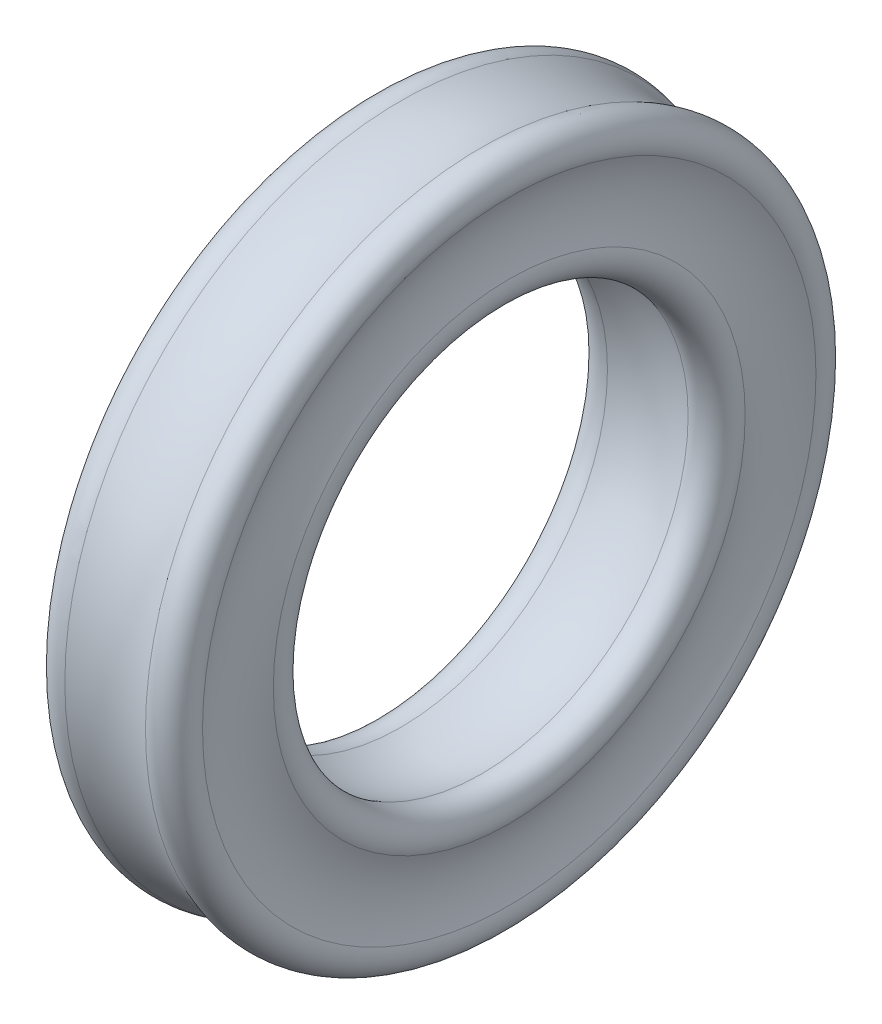
ISO-10303-21;
HEADER;
FILE_DESCRIPTION(('STEP AP214'),'2;1');
FILE_NAME('part.step','',(''),(''),'','','');
FILE_SCHEMA(('AUTOMOTIVE_DESIGN { 1 0 10303 214 1 1 1 1 }'));
ENDSEC;
DATA;
#1=APPLICATION_CONTEXT('core data for automotive mechanical design processes');
#2=APPLICATION_PROTOCOL_DEFINITION('international standard','automotive_design',2000,#1);
#3=PRODUCT_CONTEXT('',#1,'mechanical');
#4=PRODUCT('Part','Part','',(#3));
#5=PRODUCT_RELATED_PRODUCT_CATEGORY('part','',(#4));
#6=PRODUCT_DEFINITION_FORMATION('','',#4);
#7=PRODUCT_DEFINITION_CONTEXT('part definition',#1,'design');
#8=PRODUCT_DEFINITION('design','',#6,#7);
#9=PRODUCT_DEFINITION_SHAPE('','',#8);
#10=(LENGTH_UNIT() NAMED_UNIT(*) SI_UNIT(.MILLI.,.METRE.));
#11=(NAMED_UNIT(*) PLANE_ANGLE_UNIT() SI_UNIT($,.RADIAN.));
#12=(NAMED_UNIT(*) SI_UNIT($,.STERADIAN.) SOLID_ANGLE_UNIT());
#13=UNCERTAINTY_MEASURE_WITH_UNIT(LENGTH_MEASURE(1.E-05),#10,'distance_accuracy_value','');
#14=(GEOMETRIC_REPRESENTATION_CONTEXT(3) GLOBAL_UNCERTAINTY_ASSIGNED_CONTEXT((#13)) GLOBAL_UNIT_ASSIGNED_CONTEXT((#10,
#11,#12)) REPRESENTATION_CONTEXT('',''));
#15=CARTESIAN_POINT('',(0.,0.,0.));
#16=DIRECTION('',(0.,0.,1.));
#17=DIRECTION('',(1.,0.,0.));
#18=AXIS2_PLACEMENT_3D('',#15,#16,#17);
#19=CARTESIAN_POINT('',(0.,0.,0.));
#20=DIRECTION('',(1.,0.,0.));
#21=DIRECTION('',(0.,0.,-1.));
#22=AXIS2_PLACEMENT_3D('',#19,#20,#21);
#23=DEGENERATE_TOROIDAL_SURFACE('',#22,3.83118922012803,4.12518600000002,.T.);
#24=CARTESIAN_POINT('',(1.49686536342219,0.,0.));
#25=DIRECTION('',(1.,0.,0.));
#26=DIRECTION('',(0.,0.,-1.));
#27=AXIS2_PLACEMENT_3D('',#24,#25,#26);
#28=CIRCLE('',#27,7.67521752626512);
#29=CARTESIAN_POINT('',(1.49686536342219,0.,-7.67521752626512));
#30=VERTEX_POINT('',#29);
#31=EDGE_CURVE('E86',#30,#30,#28,.F.);
#32=ORIENTED_EDGE('',*,*,#31,.F.);
#33=EDGE_LOOP('',(#32));
#34=FACE_BOUND('',#33,.T.);
#35=CARTESIAN_POINT('',(-1.49686531743815,0.,0.));
#36=DIRECTION('',(1.,0.,0.));
#37=DIRECTION('',(0.,0.,-1.));
#38=AXIS2_PLACEMENT_3D('',#35,#36,#37);
#39=CIRCLE('',#38,7.67521754417131);
#40=CARTESIAN_POINT('',(-1.49686531743815,0.,-7.67521754417131));
#41=VERTEX_POINT('',#40);
#42=EDGE_CURVE('E83',#41,#41,#39,.T.);
#43=ORIENTED_EDGE('',*,*,#42,.F.);
#44=EDGE_LOOP('',(#43));
#45=FACE_BOUND('',#44,.T.);
#46=ADVANCED_FACE('F14',(#34,#45),#23,.F.);
#47=CARTESIAN_POINT('',(1.79084,0.,0.));
#48=DIRECTION('',(1.,0.,0.));
#49=DIRECTION('',(0.,0.,-1.));
#50=AXIS2_PLACEMENT_3D('',#47,#48,#49);
#51=TOROIDAL_SURFACE('',#50,8.43016,0.810160000000001);
#52=ORIENTED_EDGE('',*,*,#31,.T.);
#53=EDGE_LOOP('',(#52));
#54=FACE_BOUND('',#53,.T.);
#55=CARTESIAN_POINT('',(2.53259310120723,0.,0.));
#56=DIRECTION('',(1.,0.,0.));
#57=DIRECTION('',(0.,0.,-1.));
#58=AXIS2_PLACEMENT_3D('',#55,#56,#57);
#59=CIRCLE('',#58,8.7559844350098);
#60=CARTESIAN_POINT('',(2.53259310120723,0.,-8.7559844350098));
#61=VERTEX_POINT('',#60);
#62=EDGE_CURVE('E64',#61,#61,#59,.T.);
#63=ORIENTED_EDGE('',*,*,#62,.T.);
#64=EDGE_LOOP('',(#63));
#65=FACE_BOUND('',#64,.T.);
#66=ADVANCED_FACE('F77',(#54,#65),#51,.T.);
#67=CARTESIAN_POINT('',(-1.79084,0.,0.));
#68=DIRECTION('',(1.,0.,0.));
#69=DIRECTION('',(0.,0.,-1.));
#70=AXIS2_PLACEMENT_3D('',#67,#68,#69);
#71=TOROIDAL_SURFACE('',#70,8.43016,0.810159999999999);
#72=CARTESIAN_POINT('',(-2.53259308457556,0.,0.));
#73=DIRECTION('',(1.,0.,0.));
#74=DIRECTION('',(0.,0.,-1.));
#75=AXIS2_PLACEMENT_3D('',#72,#73,#74);
#76=CIRCLE('',#75,8.7559844728725);
#77=CARTESIAN_POINT('',(-2.53259308457556,0.,-8.7559844728725));
#78=VERTEX_POINT('',#77);
#79=EDGE_CURVE('E58',#78,#78,#76,.F.);
#80=ORIENTED_EDGE('',*,*,#79,.T.);
#81=EDGE_LOOP('',(#80));
#82=FACE_BOUND('',#81,.T.);
#83=ORIENTED_EDGE('',*,*,#42,.T.);
#84=EDGE_LOOP('',(#83));
#85=FACE_BOUND('',#84,.T.);
#86=ADVANCED_FACE('F73',(#82,#85),#71,.T.);
#87=CARTESIAN_POINT('',(5.52400531604214,0.,0.));
#88=DIRECTION('',(1.,0.,0.));
#89=DIRECTION('',(0.,0.,-1.));
#90=AXIS2_PLACEMENT_3D('',#87,#88,#89);
#91=TOROIDAL_SURFACE('',#90,10.07,3.26729);
#92=CARTESIAN_POINT('',(2.53259308457556,0.,0.));
#93=DIRECTION('',(1.,0.,0.));
#94=DIRECTION('',(0.,0.,-1.));
#95=AXIS2_PLACEMENT_3D('',#92,#93,#94);
#96=CIRCLE('',#95,11.3840155271275);
#97=CARTESIAN_POINT('',(2.53259308457556,0.,-11.3840155271275));
#98=VERTEX_POINT('',#97);
#99=EDGE_CURVE('E55',#98,#98,#96,.F.);
#100=ORIENTED_EDGE('',*,*,#99,.F.);
#101=EDGE_LOOP('',(#100));
#102=FACE_BOUND('',#101,.T.);
#103=ORIENTED_EDGE('',*,*,#62,.F.);
#104=EDGE_LOOP('',(#103));
#105=FACE_BOUND('',#104,.T.);
#106=ADVANCED_FACE('F70',(#102,#105),#91,.F.);
#107=CARTESIAN_POINT('',(-5.52400531604212,0.,0.));
#108=DIRECTION('',(1.,0.,0.));
#109=DIRECTION('',(0.,0.,-1.));
#110=AXIS2_PLACEMENT_3D('',#107,#108,#109);
#111=TOROIDAL_SURFACE('',#110,10.07,3.26728999999999);
#112=ORIENTED_EDGE('',*,*,#79,.F.);
#113=EDGE_LOOP('',(#112));
#114=FACE_BOUND('',#113,.T.);
#115=CARTESIAN_POINT('',(-2.53259309326813,0.,0.));
#116=DIRECTION('',(1.,0.,0.));
#117=DIRECTION('',(0.,0.,-1.));
#118=AXIS2_PLACEMENT_3D('',#115,#116,#117);
#119=CIRCLE('',#118,11.3840155469165);
#120=CARTESIAN_POINT('',(-2.53259309326813,0.,-11.3840155469165));
#121=VERTEX_POINT('',#120);
#122=EDGE_CURVE('E26',#121,#121,#119,.T.);
#123=ORIENTED_EDGE('',*,*,#122,.F.);
#124=EDGE_LOOP('',(#123));
#125=FACE_BOUND('',#124,.T.);
#126=ADVANCED_FACE('F48',(#114,#125),#111,.F.);
#127=CARTESIAN_POINT('',(1.79084,0.,0.));
#128=DIRECTION('',(1.,0.,0.));
#129=DIRECTION('',(0.,0.,-1.));
#130=AXIS2_PLACEMENT_3D('',#127,#128,#129);
#131=TOROIDAL_SURFACE('',#130,11.70984,0.810159999999998);
#132=ORIENTED_EDGE('',*,*,#99,.T.);
#133=EDGE_LOOP('',(#132));
#134=FACE_BOUND('',#133,.T.);
#135=CARTESIAN_POINT('',(1.49686531743814,0.,0.));
#136=DIRECTION('',(1.,0.,0.));
#137=DIRECTION('',(0.,0.,-1.));
#138=AXIS2_PLACEMENT_3D('',#135,#136,#137);
#139=CIRCLE('',#138,12.4647824558287);
#140=CARTESIAN_POINT('',(1.49686531743814,0.,-12.4647824558287));
#141=VERTEX_POINT('',#140);
#142=EDGE_CURVE('E21',#141,#141,#139,.T.);
#143=ORIENTED_EDGE('',*,*,#142,.T.);
#144=EDGE_LOOP('',(#143));
#145=FACE_BOUND('',#144,.T.);
#146=ADVANCED_FACE('F44',(#134,#145),#131,.T.);
#147=CARTESIAN_POINT('',(-1.79084,0.,0.));
#148=DIRECTION('',(1.,0.,0.));
#149=DIRECTION('',(0.,0.,-1.));
#150=AXIS2_PLACEMENT_3D('',#147,#148,#149);
#151=TOROIDAL_SURFACE('',#150,11.70984,0.810160000000001);
#152=CARTESIAN_POINT('',(-1.49686536342219,0.,0.));
#153=DIRECTION('',(1.,0.,0.));
#154=DIRECTION('',(0.,0.,-1.));
#155=AXIS2_PLACEMENT_3D('',#152,#153,#154);
#156=CIRCLE('',#155,12.4647824737349);
#157=CARTESIAN_POINT('',(-1.49686536342219,0.,-12.4647824737349));
#158=VERTEX_POINT('',#157);
#159=EDGE_CURVE('E9',#158,#158,#156,.F.);
#160=ORIENTED_EDGE('',*,*,#159,.T.);
#161=EDGE_LOOP('',(#160));
#162=FACE_BOUND('',#161,.T.);
#163=ORIENTED_EDGE('',*,*,#122,.T.);
#164=EDGE_LOOP('',(#163));
#165=FACE_BOUND('',#164,.T.);
#166=ADVANCED_FACE('F39',(#162,#165),#151,.T.);
#167=CARTESIAN_POINT('',(0.,0.,0.));
#168=DIRECTION('',(1.,0.,0.));
#169=DIRECTION('',(0.,0.,-1.));
#170=AXIS2_PLACEMENT_3D('',#167,#168,#169);
#171=TOROIDAL_SURFACE('',#170,16.308810779872,4.12518600000003);
#172=ORIENTED_EDGE('',*,*,#159,.F.);
#173=EDGE_LOOP('',(#172));
#174=FACE_BOUND('',#173,.T.);
#175=ORIENTED_EDGE('',*,*,#142,.F.);
#176=EDGE_LOOP('',(#175));
#177=FACE_BOUND('',#176,.T.);
#178=ADVANCED_FACE('F43',(#174,#177),#171,.F.);
#179=CLOSED_SHELL('',(#46,#66,#86,#106,#126,#146,#166,#178));
#180=MANIFOLD_SOLID_BREP('B1',#179);
#181=ADVANCED_BREP_SHAPE_REPRESENTATION('',(#18,#180),#14);
#182=SHAPE_DEFINITION_REPRESENTATION(#9,#181);
ENDSEC;
END-ISO-10303-21;
